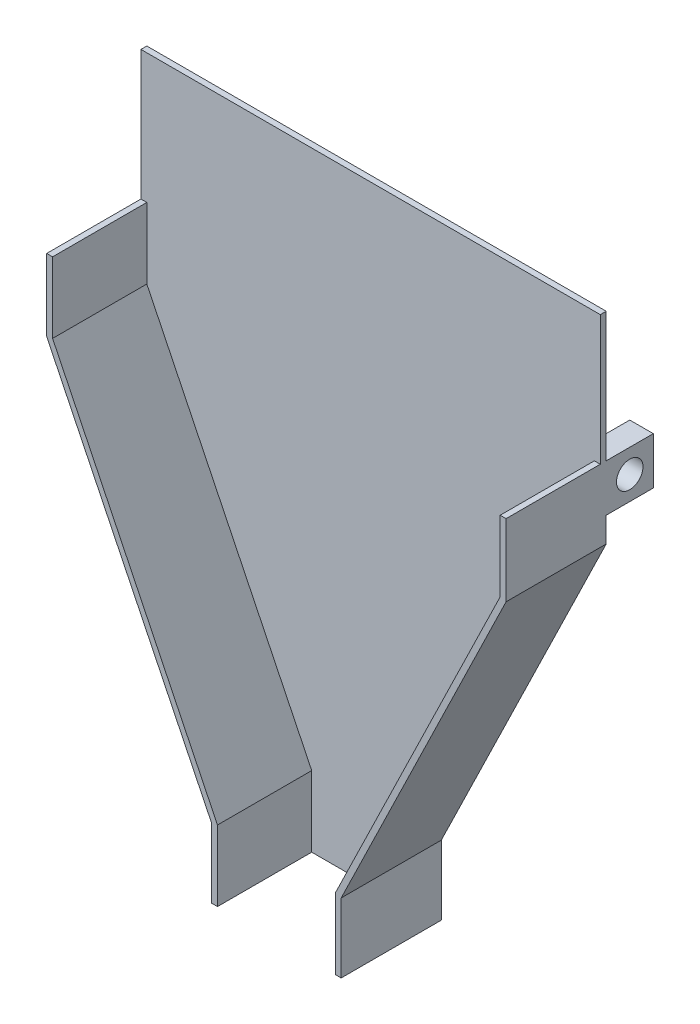
ISO-10303-21;
HEADER;
FILE_DESCRIPTION(('STEP AP214'),'2;1');
FILE_NAME('part.step','',(''),(''),'','','');
FILE_SCHEMA(('AUTOMOTIVE_DESIGN { 1 0 10303 214 1 1 1 1 }'));
ENDSEC;
DATA;
#1=APPLICATION_CONTEXT('core data for automotive mechanical design processes');
#2=APPLICATION_PROTOCOL_DEFINITION('international standard','automotive_design',2000,#1);
#3=PRODUCT_CONTEXT('',#1,'mechanical');
#4=PRODUCT('Part','Part','',(#3));
#5=PRODUCT_RELATED_PRODUCT_CATEGORY('part','',(#4));
#6=PRODUCT_DEFINITION_FORMATION('','',#4);
#7=PRODUCT_DEFINITION_CONTEXT('part definition',#1,'design');
#8=PRODUCT_DEFINITION('design','',#6,#7);
#9=PRODUCT_DEFINITION_SHAPE('','',#8);
#10=(LENGTH_UNIT() NAMED_UNIT(*) SI_UNIT(.MILLI.,.METRE.));
#11=(NAMED_UNIT(*) PLANE_ANGLE_UNIT() SI_UNIT($,.RADIAN.));
#12=(NAMED_UNIT(*) SI_UNIT($,.STERADIAN.) SOLID_ANGLE_UNIT());
#13=UNCERTAINTY_MEASURE_WITH_UNIT(LENGTH_MEASURE(1.E-05),#10,'distance_accuracy_value','');
#14=(GEOMETRIC_REPRESENTATION_CONTEXT(3) GLOBAL_UNCERTAINTY_ASSIGNED_CONTEXT((#13)) GLOBAL_UNIT_ASSIGNED_CONTEXT((#10,
#11,#12)) REPRESENTATION_CONTEXT('',''));
#15=CARTESIAN_POINT('',(0.,0.,0.));
#16=DIRECTION('',(0.,0.,1.));
#17=DIRECTION('',(1.,0.,0.));
#18=AXIS2_PLACEMENT_3D('',#15,#16,#17);
#19=CARTESIAN_POINT('',(-311.15,517.842362076429,-6.35));
#20=DIRECTION('',(0.,-1.,0.));
#21=DIRECTION('',(0.,0.,-1.));
#22=AXIS2_PLACEMENT_3D('',#19,#20,#21);
#23=PLANE('',#22);
#24=DIRECTION('',(-1.,0.,0.));
#25=VECTOR('',#24,1.);
#26=CARTESIAN_POINT('',(-311.15,517.842362076429,-6.35));
#27=LINE('',#26,#25);
#28=CARTESIAN_POINT('',(184.15,517.842362076429,-6.35));
#29=VERTEX_POINT('',#28);
#30=CARTESIAN_POINT('',(158.75,517.842362076429,-6.35));
#31=VERTEX_POINT('',#30);
#32=EDGE_CURVE('E59',#29,#31,#27,.T.);
#33=ORIENTED_EDGE('',*,*,#32,.F.);
#34=DIRECTION('',(0.,0.,1.));
#35=VECTOR('',#34,1.);
#36=CARTESIAN_POINT('',(184.15,517.842362076429,-57.15));
#37=LINE('',#36,#35);
#38=CARTESIAN_POINT('',(184.15,517.842362076429,-57.15));
#39=VERTEX_POINT('',#38);
#40=EDGE_CURVE('E390',#39,#29,#37,.T.);
#41=ORIENTED_EDGE('',*,*,#40,.F.);
#42=DIRECTION('',(1.,0.,0.));
#43=VECTOR('',#42,1.);
#44=CARTESIAN_POINT('',(184.15,517.842362076429,-57.15));
#45=LINE('',#44,#43);
#46=CARTESIAN_POINT('',(158.75,517.842362076429,-57.15));
#47=VERTEX_POINT('',#46);
#48=EDGE_CURVE('E379',#47,#39,#45,.T.);
#49=ORIENTED_EDGE('',*,*,#48,.F.);
#50=DIRECTION('',(0.,0.,1.));
#51=VECTOR('',#50,1.);
#52=CARTESIAN_POINT('',(158.75,517.842362076429,-57.15));
#53=LINE('',#52,#51);
#54=EDGE_CURVE('E394',#47,#31,#53,.T.);
#55=ORIENTED_EDGE('',*,*,#54,.T.);
#56=EDGE_LOOP('',(#33,#41,#49,#55));
#57=FACE_BOUND('',#56,.T.);
#58=ADVANCED_FACE('F47',(#57),#23,.F.);
#59=CARTESIAN_POINT('',(-285.75,517.842362076429,-6.35));
#60=VERTEX_POINT('',#59);
#61=CARTESIAN_POINT('',(-311.15,517.842362076429,-6.35));
#62=VERTEX_POINT('',#61);
#63=EDGE_CURVE('E11',#60,#62,#27,.T.);
#64=ORIENTED_EDGE('',*,*,#63,.F.);
#65=DIRECTION('',(0.,0.,1.));
#66=VECTOR('',#65,1.);
#67=CARTESIAN_POINT('',(-285.75,517.842362076429,-57.15));
#68=LINE('',#67,#66);
#69=CARTESIAN_POINT('',(-285.75,517.842362076429,-57.15));
#70=VERTEX_POINT('',#69);
#71=EDGE_CURVE('E270',#70,#60,#68,.T.);
#72=ORIENTED_EDGE('',*,*,#71,.F.);
#73=DIRECTION('',(1.,0.,0.));
#74=VECTOR('',#73,1.);
#75=CARTESIAN_POINT('',(-311.15,517.842362076429,-57.15));
#76=LINE('',#75,#74);
#77=CARTESIAN_POINT('',(-311.15,517.842362076429,-57.15));
#78=VERTEX_POINT('',#77);
#79=EDGE_CURVE('E296',#78,#70,#76,.T.);
#80=ORIENTED_EDGE('',*,*,#79,.F.);
#81=DIRECTION('',(0.,0.,1.));
#82=VECTOR('',#81,1.);
#83=CARTESIAN_POINT('',(-311.15,517.842362076429,-6.35));
#84=LINE('',#83,#82);
#85=EDGE_CURVE('E74',#78,#62,#84,.T.);
#86=ORIENTED_EDGE('',*,*,#85,.T.);
#87=EDGE_LOOP('',(#64,#72,#80,#86));
#88=FACE_BOUND('',#87,.T.);
#89=ADVANCED_FACE('F533',(#88),#23,.F.);
#90=DIRECTION('',(1.,0.,0.));
#91=VECTOR('',#90,1.);
#92=CARTESIAN_POINT('',(-311.15,517.842362076429,0.));
#93=LINE('',#92,#91);
#94=CARTESIAN_POINT('',(-311.15,517.842362076429,0.));
#95=VERTEX_POINT('',#94);
#96=CARTESIAN_POINT('',(-304.8,517.842362076429,0.));
#97=VERTEX_POINT('',#96);
#98=EDGE_CURVE('E66',#95,#97,#93,.T.);
#99=ORIENTED_EDGE('',*,*,#98,.F.);
#100=CARTESIAN_POINT('',(-311.15,517.842362076429,101.6));
#101=VERTEX_POINT('',#100);
#102=EDGE_CURVE('E250',#95,#101,#84,.T.);
#103=ORIENTED_EDGE('',*,*,#102,.T.);
#104=DIRECTION('',(1.,0.,0.));
#105=VECTOR('',#104,1.);
#106=CARTESIAN_POINT('',(-311.15,517.842362076429,101.6));
#107=LINE('',#106,#105);
#108=CARTESIAN_POINT('',(-304.8,517.842362076429,101.6));
#109=VERTEX_POINT('',#108);
#110=EDGE_CURVE('E493',#101,#109,#107,.T.);
#111=ORIENTED_EDGE('',*,*,#110,.T.);
#112=DIRECTION('',(0.,0.,1.));
#113=VECTOR('',#112,1.);
#114=CARTESIAN_POINT('',(-304.8,517.842362076429,-6.35));
#115=LINE('',#114,#113);
#116=EDGE_CURVE('E432',#97,#109,#115,.T.);
#117=ORIENTED_EDGE('',*,*,#116,.F.);
#118=EDGE_LOOP('',(#99,#103,#111,#117));
#119=FACE_BOUND('',#118,.T.);
#120=ADVANCED_FACE('F505',(#119),#23,.F.);
#121=CARTESIAN_POINT('',(177.8,517.842362076429,0.));
#122=VERTEX_POINT('',#121);
#123=CARTESIAN_POINT('',(184.15,517.842362076429,0.));
#124=VERTEX_POINT('',#123);
#125=EDGE_CURVE('E57',#122,#124,#93,.T.);
#126=ORIENTED_EDGE('',*,*,#125,.F.);
#127=DIRECTION('',(0.,0.,-1.));
#128=VECTOR('',#127,1.);
#129=CARTESIAN_POINT('',(177.8,517.842362076429,101.6));
#130=LINE('',#129,#128);
#131=CARTESIAN_POINT('',(177.8,517.842362076429,101.6));
#132=VERTEX_POINT('',#131);
#133=EDGE_CURVE('E340',#132,#122,#130,.T.);
#134=ORIENTED_EDGE('',*,*,#133,.F.);
#135=DIRECTION('',(1.,0.,0.));
#136=VECTOR('',#135,1.);
#137=CARTESIAN_POINT('',(177.8,517.842362076429,101.6));
#138=LINE('',#137,#136);
#139=CARTESIAN_POINT('',(184.15,517.842362076429,101.6));
#140=VERTEX_POINT('',#139);
#141=EDGE_CURVE('E322',#132,#140,#138,.T.);
#142=ORIENTED_EDGE('',*,*,#141,.T.);
#143=EDGE_CURVE('E382',#124,#140,#37,.T.);
#144=ORIENTED_EDGE('',*,*,#143,.F.);
#145=EDGE_LOOP('',(#126,#134,#142,#144));
#146=FACE_BOUND('',#145,.T.);
#147=ADVANCED_FACE('F536',(#146),#23,.F.);
#148=CARTESIAN_POINT('',(0.,0.,-6.35));
#149=DIRECTION('',(0.,0.,-1.));
#150=DIRECTION('',(-1.,0.,0.));
#151=AXIS2_PLACEMENT_3D('',#148,#149,#150);
#152=PLANE('',#151);
#153=DIRECTION('',(-1.,0.,0.));
#154=VECTOR('',#153,1.);
#155=CARTESIAN_POINT('',(-311.15,467.042362076429,-6.35));
#156=LINE('',#155,#154);
#157=CARTESIAN_POINT('',(-285.75,467.042362076429,-6.35));
#158=VERTEX_POINT('',#157);
#159=CARTESIAN_POINT('',(-311.15,467.042362076429,-6.35));
#160=VERTEX_POINT('',#159);
#161=EDGE_CURVE('E282',#158,#160,#156,.T.);
#162=ORIENTED_EDGE('',*,*,#161,.F.);
#163=DIRECTION('',(0.,-1.,0.));
#164=VECTOR('',#163,1.);
#165=CARTESIAN_POINT('',(-285.75,517.842362076429,-6.35));
#166=LINE('',#165,#164);
#167=EDGE_CURVE('E285',#60,#158,#166,.T.);
#168=ORIENTED_EDGE('',*,*,#167,.F.);
#169=ORIENTED_EDGE('',*,*,#63,.T.);
#170=DIRECTION('',(0.,-1.,0.));
#171=VECTOR('',#170,1.);
#172=CARTESIAN_POINT('',(-311.15,657.542362076429,-6.35));
#173=LINE('',#172,#171);
#174=CARTESIAN_POINT('',(-311.15,657.542362076429,-6.35));
#175=VERTEX_POINT('',#174);
#176=EDGE_CURVE('E582',#175,#62,#173,.T.);
#177=ORIENTED_EDGE('',*,*,#176,.F.);
#178=DIRECTION('',(-1.,0.,0.));
#179=VECTOR('',#178,1.);
#180=CARTESIAN_POINT('',(-311.15,657.542362076429,-6.35));
#181=LINE('',#180,#179);
#182=CARTESIAN_POINT('',(184.15,657.542362076429,-6.35));
#183=VERTEX_POINT('',#182);
#184=EDGE_CURVE('E242',#183,#175,#181,.T.);
#185=ORIENTED_EDGE('',*,*,#184,.F.);
#186=DIRECTION('',(0.,-1.,0.));
#187=VECTOR('',#186,1.);
#188=CARTESIAN_POINT('',(184.15,657.542362076429,-6.35));
#189=LINE('',#188,#187);
#190=EDGE_CURVE('E259',#183,#29,#189,.T.);
#191=ORIENTED_EDGE('',*,*,#190,.T.);
#192=ORIENTED_EDGE('',*,*,#32,.T.);
#193=DIRECTION('',(0.,1.,0.));
#194=VECTOR('',#193,1.);
#195=CARTESIAN_POINT('',(158.75,517.842362076429,-6.35));
#196=LINE('',#195,#194);
#197=CARTESIAN_POINT('',(158.75,467.042362076429,-6.35));
#198=VERTEX_POINT('',#197);
#199=EDGE_CURVE('E359',#198,#31,#196,.T.);
#200=ORIENTED_EDGE('',*,*,#199,.F.);
#201=DIRECTION('',(-1.,0.,0.));
#202=VECTOR('',#201,1.);
#203=CARTESIAN_POINT('',(184.15,467.042362076429,-6.35));
#204=LINE('',#203,#202);
#205=CARTESIAN_POINT('',(184.15,467.042362076429,-6.35));
#206=VERTEX_POINT('',#205);
#207=EDGE_CURVE('E383',#206,#198,#204,.T.);
#208=ORIENTED_EDGE('',*,*,#207,.F.);
#209=DIRECTION('',(0.,1.,0.));
#210=VECTOR('',#209,1.);
#211=CARTESIAN_POINT('',(184.15,517.842362076429,-6.35));
#212=LINE('',#211,#210);
#213=CARTESIAN_POINT('',(184.15,440.179589293445,-6.35));
#214=VERTEX_POINT('',#213);
#215=EDGE_CURVE('E306',#206,#214,#212,.F.);
#216=ORIENTED_EDGE('',*,*,#215,.T.);
#217=DIRECTION('',(-0.4375,-0.899218410621135,0.));
#218=VECTOR('',#217,1.);
#219=CARTESIAN_POINT('',(5.71003690744421,73.421875,-6.35));
#220=LINE('',#219,#218);
#221=CARTESIAN_POINT('',(6.35,74.7372272170153,-6.35));
#222=VERTEX_POINT('',#221);
#223=EDGE_CURVE('E363',#214,#222,#220,.T.);
#224=ORIENTED_EDGE('',*,*,#223,.T.);
#225=DIRECTION('',(0.,1.,0.));
#226=VECTOR('',#225,1.);
#227=CARTESIAN_POINT('',(6.35,0.,-6.35));
#228=LINE('',#227,#226);
#229=CARTESIAN_POINT('',(6.35,0.,-6.35));
#230=VERTEX_POINT('',#229);
#231=EDGE_CURVE('E290',#222,#230,#228,.F.);
#232=ORIENTED_EDGE('',*,*,#231,.T.);
#233=DIRECTION('',(-1.,0.,0.));
#234=VECTOR('',#233,1.);
#235=CARTESIAN_POINT('',(-127.,0.,-6.35));
#236=LINE('',#235,#234);
#237=CARTESIAN_POINT('',(-133.35,0.,-6.35));
#238=VERTEX_POINT('',#237);
#239=EDGE_CURVE('E435',#230,#238,#236,.T.);
#240=ORIENTED_EDGE('',*,*,#239,.T.);
#241=DIRECTION('',(0.,1.,0.));
#242=VECTOR('',#241,1.);
#243=CARTESIAN_POINT('',(-133.35,76.2,-6.35));
#244=LINE('',#243,#242);
#245=CARTESIAN_POINT('',(-133.35,74.7372272170153,-6.35));
#246=VERTEX_POINT('',#245);
#247=EDGE_CURVE('E458',#238,#246,#244,.T.);
#248=ORIENTED_EDGE('',*,*,#247,.T.);
#249=DIRECTION('',(-0.4375,0.899218410621135,0.));
#250=VECTOR('',#249,1.);
#251=CARTESIAN_POINT('',(-310.510036907444,438.864237076429,-6.35));
#252=LINE('',#251,#250);
#253=CARTESIAN_POINT('',(-311.15,440.179589293445,-6.35));
#254=VERTEX_POINT('',#253);
#255=EDGE_CURVE('E462',#246,#254,#252,.T.);
#256=ORIENTED_EDGE('',*,*,#255,.T.);
#257=DIRECTION('',(0.,1.,0.));
#258=VECTOR('',#257,1.);
#259=CARTESIAN_POINT('',(-311.15,441.642362076429,-6.35));
#260=LINE('',#259,#258);
#261=EDGE_CURVE('E466',#254,#160,#260,.T.);
#262=ORIENTED_EDGE('',*,*,#261,.T.);
#263=EDGE_LOOP('',(#162,#168,#169,#177,#185,#191,#192,#200,#208,#216,#224,#232,#240,#248,#256,#262));
#264=FACE_BOUND('',#263,.T.);
#265=ADVANCED_FACE('F543',(#264),#152,.T.);
#266=CARTESIAN_POINT('',(-304.8,441.642362076429,-6.35));
#267=DIRECTION('',(0.899218410621135,0.4375,0.));
#268=DIRECTION('',(-0.4375,0.899218410621135,0.));
#269=AXIS2_PLACEMENT_3D('',#266,#267,#268);
#270=PLANE('',#269);
#271=DIRECTION('',(0.4375,-0.899218410621135,0.));
#272=VECTOR('',#271,1.);
#273=CARTESIAN_POINT('',(-72.7137124859179,-35.3776666901368,0.));
#274=LINE('',#273,#272);
#275=CARTESIAN_POINT('',(-304.8,441.642362076429,0.));
#276=VERTEX_POINT('',#275);
#277=CARTESIAN_POINT('',(-127.,76.2,0.));
#278=VERTEX_POINT('',#277);
#279=EDGE_CURVE('E427',#276,#278,#274,.T.);
#280=ORIENTED_EDGE('',*,*,#279,.F.);
#281=DIRECTION('',(0.,0.,1.));
#282=VECTOR('',#281,1.);
#283=CARTESIAN_POINT('',(-304.8,441.642362076429,-6.35));
#284=LINE('',#283,#282);
#285=CARTESIAN_POINT('',(-304.8,441.642362076429,101.6));
#286=VERTEX_POINT('',#285);
#287=EDGE_CURVE('E431',#276,#286,#284,.T.);
#288=ORIENTED_EDGE('',*,*,#287,.T.);
#289=DIRECTION('',(-0.4375,0.899218410621135,0.));
#290=VECTOR('',#289,1.);
#291=CARTESIAN_POINT('',(-304.8,441.642362076429,101.6));
#292=LINE('',#291,#290);
#293=CARTESIAN_POINT('',(-127.,76.2,101.6));
#294=VERTEX_POINT('',#293);
#295=EDGE_CURVE('E470',#294,#286,#292,.T.);
#296=ORIENTED_EDGE('',*,*,#295,.F.);
#297=DIRECTION('',(0.,0.,1.));
#298=VECTOR('',#297,1.);
#299=CARTESIAN_POINT('',(-127.,76.2,-6.35));
#300=LINE('',#299,#298);
#301=EDGE_CURVE('E450',#278,#294,#300,.T.);
#302=ORIENTED_EDGE('',*,*,#301,.F.);
#303=EDGE_LOOP('',(#280,#288,#296,#302));
#304=FACE_BOUND('',#303,.T.);
#305=ADVANCED_FACE('F549',(#304),#270,.T.);
#306=CARTESIAN_POINT('',(0.,0.,101.6));
#307=DIRECTION('',(0.,0.,-1.));
#308=DIRECTION('',(-1.,0.,0.));
#309=AXIS2_PLACEMENT_3D('',#306,#307,#308);
#310=PLANE('',#309);
#311=DIRECTION('',(0.,1.,0.));
#312=VECTOR('',#311,1.);
#313=CARTESIAN_POINT('',(-304.8,441.642362076429,101.6));
#314=LINE('',#313,#312);
#315=EDGE_CURVE('E387',#286,#109,#314,.T.);
#316=ORIENTED_EDGE('',*,*,#315,.T.);
#317=ORIENTED_EDGE('',*,*,#110,.F.);
#318=DIRECTION('',(0.,1.,0.));
#319=VECTOR('',#318,1.);
#320=CARTESIAN_POINT('',(-311.15,441.642362076429,101.6));
#321=LINE('',#320,#319);
#322=CARTESIAN_POINT('',(-311.15,440.179589293445,101.6));
#323=VERTEX_POINT('',#322);
#324=EDGE_CURVE('E490',#323,#101,#321,.T.);
#325=ORIENTED_EDGE('',*,*,#324,.F.);
#326=DIRECTION('',(-0.4375,0.899218410621135,0.));
#327=VECTOR('',#326,1.);
#328=CARTESIAN_POINT('',(-310.510036907444,438.864237076429,101.6));
#329=LINE('',#328,#327);
#330=CARTESIAN_POINT('',(-133.35,74.7372272170153,101.6));
#331=VERTEX_POINT('',#330);
#332=EDGE_CURVE('E486',#331,#323,#329,.T.);
#333=ORIENTED_EDGE('',*,*,#332,.F.);
#334=DIRECTION('',(0.,1.,0.));
#335=VECTOR('',#334,1.);
#336=CARTESIAN_POINT('',(-133.35,76.2,101.6));
#337=LINE('',#336,#335);
#338=CARTESIAN_POINT('',(-133.35,0.,101.6));
#339=VERTEX_POINT('',#338);
#340=EDGE_CURVE('E482',#339,#331,#337,.T.);
#341=ORIENTED_EDGE('',*,*,#340,.F.);
#342=DIRECTION('',(-1.,0.,0.));
#343=VECTOR('',#342,1.);
#344=CARTESIAN_POINT('',(-127.,0.,101.6));
#345=LINE('',#344,#343);
#346=CARTESIAN_POINT('',(-127.,0.,101.6));
#347=VERTEX_POINT('',#346);
#348=EDGE_CURVE('E478',#347,#339,#345,.T.);
#349=ORIENTED_EDGE('',*,*,#348,.F.);
#350=DIRECTION('',(0.,1.,0.));
#351=VECTOR('',#350,1.);
#352=CARTESIAN_POINT('',(-127.,76.2,101.6));
#353=LINE('',#352,#351);
#354=EDGE_CURVE('E474',#347,#294,#353,.T.);
#355=ORIENTED_EDGE('',*,*,#354,.T.);
#356=ORIENTED_EDGE('',*,*,#295,.T.);
#357=EDGE_LOOP('',(#316,#317,#325,#333,#341,#349,#355,#356));
#358=FACE_BOUND('',#357,.T.);
#359=ADVANCED_FACE('F49',(#358),#310,.F.);
#360=CARTESIAN_POINT('',(-127.,76.2,-6.35));
#361=DIRECTION('',(1.,0.,0.));
#362=DIRECTION('',(0.,1.,0.));
#363=AXIS2_PLACEMENT_3D('',#360,#361,#362);
#364=PLANE('',#363);
#365=DIRECTION('',(0.,-1.,0.));
#366=VECTOR('',#365,1.);
#367=CARTESIAN_POINT('',(-127.,0.,0.));
#368=LINE('',#367,#366);
#369=CARTESIAN_POINT('',(-127.,0.,0.));
#370=VERTEX_POINT('',#369);
#371=EDGE_CURVE('E406',#278,#370,#368,.T.);
#372=ORIENTED_EDGE('',*,*,#371,.F.);
#373=ORIENTED_EDGE('',*,*,#301,.T.);
#374=ORIENTED_EDGE('',*,*,#354,.F.);
#375=DIRECTION('',(0.,0.,1.));
#376=VECTOR('',#375,1.);
#377=CARTESIAN_POINT('',(-127.,0.,-6.35));
#378=LINE('',#377,#376);
#379=EDGE_CURVE('E447',#370,#347,#378,.T.);
#380=ORIENTED_EDGE('',*,*,#379,.F.);
#381=EDGE_LOOP('',(#372,#373,#374,#380));
#382=FACE_BOUND('',#381,.T.);
#383=ADVANCED_FACE('F618',(#382),#364,.T.);
#384=CARTESIAN_POINT('',(-127.,0.,-6.35));
#385=DIRECTION('',(0.,1.,0.));
#386=DIRECTION('',(0.,0.,1.));
#387=AXIS2_PLACEMENT_3D('',#384,#385,#386);
#388=PLANE('',#387);
#389=DIRECTION('',(0.,0.,1.));
#390=VECTOR('',#389,1.);
#391=CARTESIAN_POINT('',(-133.35,0.,-6.35));
#392=LINE('',#391,#390);
#393=EDGE_CURVE('E444',#238,#339,#392,.T.);
#394=ORIENTED_EDGE('',*,*,#393,.F.);
#395=ORIENTED_EDGE('',*,*,#239,.F.);
#396=DIRECTION('',(0.,0.,-1.));
#397=VECTOR('',#396,1.);
#398=CARTESIAN_POINT('',(6.35,0.,101.6));
#399=LINE('',#398,#397);
#400=CARTESIAN_POINT('',(6.35,0.,101.6));
#401=VERTEX_POINT('',#400);
#402=EDGE_CURVE('E351',#401,#230,#399,.T.);
#403=ORIENTED_EDGE('',*,*,#402,.F.);
#404=DIRECTION('',(-1.,0.,0.));
#405=VECTOR('',#404,1.);
#406=CARTESIAN_POINT('',(6.35,0.,101.6));
#407=LINE('',#406,#405);
#408=CARTESIAN_POINT('',(0.,0.,101.6));
#409=VERTEX_POINT('',#408);
#410=EDGE_CURVE('E305',#401,#409,#407,.T.);
#411=ORIENTED_EDGE('',*,*,#410,.T.);
#412=DIRECTION('',(0.,0.,-1.));
#413=VECTOR('',#412,1.);
#414=CARTESIAN_POINT('',(0.,0.,101.6));
#415=LINE('',#414,#413);
#416=CARTESIAN_POINT('',(0.,0.,0.));
#417=VERTEX_POINT('',#416);
#418=EDGE_CURVE('E355',#409,#417,#415,.T.);
#419=ORIENTED_EDGE('',*,*,#418,.T.);
#420=DIRECTION('',(1.,0.,0.));
#421=VECTOR('',#420,1.);
#422=CARTESIAN_POINT('',(0.,0.,0.));
#423=LINE('',#422,#421);
#424=EDGE_CURVE('E409',#370,#417,#423,.T.);
#425=ORIENTED_EDGE('',*,*,#424,.F.);
#426=ORIENTED_EDGE('',*,*,#379,.T.);
#427=ORIENTED_EDGE('',*,*,#348,.T.);
#428=EDGE_LOOP('',(#394,#395,#403,#411,#419,#425,#426,#427));
#429=FACE_BOUND('',#428,.T.);
#430=ADVANCED_FACE('F610',(#429),#388,.F.);
#431=CARTESIAN_POINT('',(-133.35,76.2,-6.35));
#432=DIRECTION('',(1.,0.,0.));
#433=DIRECTION('',(0.,1.,0.));
#434=AXIS2_PLACEMENT_3D('',#431,#432,#433);
#435=PLANE('',#434);
#436=DIRECTION('',(0.,0.,1.));
#437=VECTOR('',#436,1.);
#438=CARTESIAN_POINT('',(-133.35,74.7372272170153,-6.35));
#439=LINE('',#438,#437);
#440=EDGE_CURVE('E441',#246,#331,#439,.T.);
#441=ORIENTED_EDGE('',*,*,#440,.F.);
#442=ORIENTED_EDGE('',*,*,#247,.F.);
#443=ORIENTED_EDGE('',*,*,#393,.T.);
#444=ORIENTED_EDGE('',*,*,#340,.T.);
#445=EDGE_LOOP('',(#441,#442,#443,#444));
#446=FACE_BOUND('',#445,.T.);
#447=ADVANCED_FACE('F608',(#446),#435,.F.);
#448=CARTESIAN_POINT('',(-310.510036907444,438.864237076429,-6.35));
#449=DIRECTION('',(0.899218410621135,0.4375,0.));
#450=DIRECTION('',(-0.4375,0.899218410621135,0.));
#451=AXIS2_PLACEMENT_3D('',#448,#449,#450);
#452=PLANE('',#451);
#453=DIRECTION('',(0.,0.,1.));
#454=VECTOR('',#453,1.);
#455=CARTESIAN_POINT('',(-311.15,440.179589293445,-6.35));
#456=LINE('',#455,#454);
#457=EDGE_CURVE('E438',#254,#323,#456,.T.);
#458=ORIENTED_EDGE('',*,*,#457,.F.);
#459=ORIENTED_EDGE('',*,*,#255,.F.);
#460=ORIENTED_EDGE('',*,*,#440,.T.);
#461=ORIENTED_EDGE('',*,*,#332,.T.);
#462=EDGE_LOOP('',(#458,#459,#460,#461));
#463=FACE_BOUND('',#462,.T.);
#464=ADVANCED_FACE('F603',(#463),#452,.F.);
#465=CARTESIAN_POINT('',(-311.15,441.642362076429,-6.35));
#466=DIRECTION('',(1.,0.,0.));
#467=DIRECTION('',(0.,0.,-1.));
#468=AXIS2_PLACEMENT_3D('',#465,#466,#467);
#469=PLANE('',#468);
#470=CARTESIAN_POINT('',(-311.15,492.442362076429,-31.75));
#471=DIRECTION('',(1.,0.,0.));
#472=DIRECTION('',(0.,0.,-1.));
#473=AXIS2_PLACEMENT_3D('',#470,#471,#472);
#474=CIRCLE('',#473,14.2875);
#475=CARTESIAN_POINT('',(-311.15,492.442362076429,-46.0375));
#476=VERTEX_POINT('',#475);
#477=EDGE_CURVE('E257',#476,#476,#474,.T.);
#478=ORIENTED_EDGE('',*,*,#477,.T.);
#479=EDGE_LOOP('',(#478));
#480=FACE_BOUND('',#479,.T.);
#481=ORIENTED_EDGE('',*,*,#85,.F.);
#482=DIRECTION('',(0.,1.,0.));
#483=VECTOR('',#482,1.);
#484=CARTESIAN_POINT('',(-311.15,517.842362076429,-57.15));
#485=LINE('',#484,#483);
#486=CARTESIAN_POINT('',(-311.15,467.042362076429,-57.15));
#487=VERTEX_POINT('',#486);
#488=EDGE_CURVE('E286',#487,#78,#485,.T.);
#489=ORIENTED_EDGE('',*,*,#488,.F.);
#490=DIRECTION('',(0.,0.,1.));
#491=VECTOR('',#490,1.);
#492=CARTESIAN_POINT('',(-311.15,467.042362076429,-57.15));
#493=LINE('',#492,#491);
#494=EDGE_CURVE('E277',#487,#160,#493,.T.);
#495=ORIENTED_EDGE('',*,*,#494,.T.);
#496=ORIENTED_EDGE('',*,*,#261,.F.);
#497=ORIENTED_EDGE('',*,*,#457,.T.);
#498=ORIENTED_EDGE('',*,*,#324,.T.);
#499=ORIENTED_EDGE('',*,*,#102,.F.);
#500=DIRECTION('',(0.,-1.,0.));
#501=VECTOR('',#500,1.);
#502=CARTESIAN_POINT('',(-311.15,657.542362076429,0.));
#503=LINE('',#502,#501);
#504=CARTESIAN_POINT('',(-311.15,657.542362076429,0.));
#505=VERTEX_POINT('',#504);
#506=EDGE_CURVE('E229',#505,#95,#503,.T.);
#507=ORIENTED_EDGE('',*,*,#506,.F.);
#508=DIRECTION('',(0.,0.,1.));
#509=VECTOR('',#508,1.);
#510=CARTESIAN_POINT('',(-311.15,657.542362076429,0.));
#511=LINE('',#510,#509);
#512=EDGE_CURVE('E237',#175,#505,#511,.T.);
#513=ORIENTED_EDGE('',*,*,#512,.F.);
#514=ORIENTED_EDGE('',*,*,#176,.T.);
#515=EDGE_LOOP('',(#481,#489,#495,#496,#497,#498,#499,#507,#513,#514));
#516=FACE_BOUND('',#515,.T.);
#517=ADVANCED_FACE('F248',(#480,#516),#469,.F.);
#518=CARTESIAN_POINT('',(-304.8,441.642362076429,-6.35));
#519=DIRECTION('',(1.,0.,0.));
#520=DIRECTION('',(0.,0.,-1.));
#521=AXIS2_PLACEMENT_3D('',#518,#519,#520);
#522=PLANE('',#521);
#523=DIRECTION('',(0.,1.,0.));
#524=VECTOR('',#523,1.);
#525=CARTESIAN_POINT('',(-304.8,0.,0.));
#526=LINE('',#525,#524);
#527=EDGE_CURVE('E424',#276,#97,#526,.T.);
#528=ORIENTED_EDGE('',*,*,#527,.T.);
#529=ORIENTED_EDGE('',*,*,#116,.T.);
#530=ORIENTED_EDGE('',*,*,#315,.F.);
#531=ORIENTED_EDGE('',*,*,#287,.F.);
#532=EDGE_LOOP('',(#528,#529,#530,#531));
#533=FACE_BOUND('',#532,.T.);
#534=ADVANCED_FACE('F621',(#533),#522,.T.);
#535=CARTESIAN_POINT('',(0.,0.,0.));
#536=DIRECTION('',(0.,0.,1.));
#537=DIRECTION('',(1.,0.,0.));
#538=AXIS2_PLACEMENT_3D('',#535,#536,#537);
#539=PLANE('',#538);
#540=ORIENTED_EDGE('',*,*,#371,.T.);
#541=ORIENTED_EDGE('',*,*,#424,.T.);
#542=DIRECTION('',(0.,1.,0.));
#543=VECTOR('',#542,1.);
#544=CARTESIAN_POINT('',(0.,0.,0.));
#545=LINE('',#544,#543);
#546=CARTESIAN_POINT('',(0.,76.2,0.));
#547=VERTEX_POINT('',#546);
#548=EDGE_CURVE('E413',#417,#547,#545,.T.);
#549=ORIENTED_EDGE('',*,*,#548,.T.);
#550=DIRECTION('',(0.4375,0.899218410621135,0.));
#551=VECTOR('',#550,1.);
#552=CARTESIAN_POINT('',(-29.9776937640821,14.58515625,0.));
#553=LINE('',#552,#551);
#554=CARTESIAN_POINT('',(177.8,441.642362076429,0.));
#555=VERTEX_POINT('',#554);
#556=EDGE_CURVE('E417',#547,#555,#553,.T.);
#557=ORIENTED_EDGE('',*,*,#556,.T.);
#558=DIRECTION('',(0.,-1.,0.));
#559=VECTOR('',#558,1.);
#560=CARTESIAN_POINT('',(177.8,0.,0.));
#561=LINE('',#560,#559);
#562=EDGE_CURVE('E421',#122,#555,#561,.T.);
#563=ORIENTED_EDGE('',*,*,#562,.F.);
#564=ORIENTED_EDGE('',*,*,#125,.T.);
#565=DIRECTION('',(0.,-1.,0.));
#566=VECTOR('',#565,1.);
#567=CARTESIAN_POINT('',(184.15,657.542362076429,0.));
#568=LINE('',#567,#566);
#569=CARTESIAN_POINT('',(184.15,657.542362076429,0.));
#570=VERTEX_POINT('',#569);
#571=EDGE_CURVE('E232',#570,#124,#568,.T.);
#572=ORIENTED_EDGE('',*,*,#571,.F.);
#573=DIRECTION('',(1.,0.,0.));
#574=VECTOR('',#573,1.);
#575=CARTESIAN_POINT('',(-311.15,657.542362076429,0.));
#576=LINE('',#575,#574);
#577=EDGE_CURVE('E224',#505,#570,#576,.T.);
#578=ORIENTED_EDGE('',*,*,#577,.F.);
#579=ORIENTED_EDGE('',*,*,#506,.T.);
#580=ORIENTED_EDGE('',*,*,#98,.T.);
#581=ORIENTED_EDGE('',*,*,#527,.F.);
#582=ORIENTED_EDGE('',*,*,#279,.T.);
#583=EDGE_LOOP('',(#540,#541,#549,#557,#563,#564,#572,#578,#579,#580,#581,#582));
#584=FACE_BOUND('',#583,.T.);
#585=ADVANCED_FACE('F227',(#584),#539,.T.);
#586=CARTESIAN_POINT('',(184.15,517.842362076429,-57.15));
#587=DIRECTION('',(-1.,0.,0.));
#588=DIRECTION('',(0.,0.,1.));
#589=AXIS2_PLACEMENT_3D('',#586,#587,#588);
#590=PLANE('',#589);
#591=CARTESIAN_POINT('',(184.15,492.442362076429,-31.75));
#592=DIRECTION('',(1.,0.,0.));
#593=DIRECTION('',(0.,0.,-1.));
#594=AXIS2_PLACEMENT_3D('',#591,#592,#593);
#595=CIRCLE('',#594,14.2875);
#596=CARTESIAN_POINT('',(184.15,492.442362076429,-46.0375));
#597=VERTEX_POINT('',#596);
#598=EDGE_CURVE('E252',#597,#597,#595,.T.);
#599=ORIENTED_EDGE('',*,*,#598,.F.);
#600=EDGE_LOOP('',(#599));
#601=FACE_BOUND('',#600,.T.);
#602=ORIENTED_EDGE('',*,*,#40,.T.);
#603=ORIENTED_EDGE('',*,*,#190,.F.);
#604=DIRECTION('',(0.,0.,-1.));
#605=VECTOR('',#604,1.);
#606=CARTESIAN_POINT('',(184.15,657.542362076429,0.));
#607=LINE('',#606,#605);
#608=EDGE_CURVE('E236',#570,#183,#607,.T.);
#609=ORIENTED_EDGE('',*,*,#608,.F.);
#610=ORIENTED_EDGE('',*,*,#571,.T.);
#611=ORIENTED_EDGE('',*,*,#143,.T.);
#612=DIRECTION('',(0.,1.,0.));
#613=VECTOR('',#612,1.);
#614=CARTESIAN_POINT('',(184.15,517.842362076429,101.6));
#615=LINE('',#614,#613);
#616=CARTESIAN_POINT('',(184.15,440.179589293445,101.6));
#617=VERTEX_POINT('',#616);
#618=EDGE_CURVE('E318',#140,#617,#615,.F.);
#619=ORIENTED_EDGE('',*,*,#618,.T.);
#620=DIRECTION('',(0.,0.,-1.));
#621=VECTOR('',#620,1.);
#622=CARTESIAN_POINT('',(184.15,440.179589293445,101.6));
#623=LINE('',#622,#621);
#624=EDGE_CURVE('E344',#617,#214,#623,.T.);
#625=ORIENTED_EDGE('',*,*,#624,.T.);
#626=ORIENTED_EDGE('',*,*,#215,.F.);
#627=DIRECTION('',(0.,0.,1.));
#628=VECTOR('',#627,1.);
#629=CARTESIAN_POINT('',(184.15,467.042362076429,-57.15));
#630=LINE('',#629,#628);
#631=CARTESIAN_POINT('',(184.15,467.042362076429,-57.15));
#632=VERTEX_POINT('',#631);
#633=EDGE_CURVE('E402',#632,#206,#630,.T.);
#634=ORIENTED_EDGE('',*,*,#633,.F.);
#635=DIRECTION('',(0.,-1.,0.));
#636=VECTOR('',#635,1.);
#637=CARTESIAN_POINT('',(184.15,517.842362076429,-57.15));
#638=LINE('',#637,#636);
#639=EDGE_CURVE('E369',#39,#632,#638,.T.);
#640=ORIENTED_EDGE('',*,*,#639,.F.);
#641=EDGE_LOOP('',(#602,#603,#609,#610,#611,#619,#625,#626,#634,#640));
#642=FACE_BOUND('',#641,.T.);
#643=ADVANCED_FACE('F574',(#601,#642),#590,.F.);
#644=CARTESIAN_POINT('',(184.15,467.042362076429,-57.15));
#645=DIRECTION('',(0.,1.,0.));
#646=DIRECTION('',(0.,0.,1.));
#647=AXIS2_PLACEMENT_3D('',#644,#645,#646);
#648=PLANE('',#647);
#649=ORIENTED_EDGE('',*,*,#633,.T.);
#650=ORIENTED_EDGE('',*,*,#207,.T.);
#651=DIRECTION('',(0.,0.,1.));
#652=VECTOR('',#651,1.);
#653=CARTESIAN_POINT('',(158.75,467.042362076429,-57.15));
#654=LINE('',#653,#652);
#655=CARTESIAN_POINT('',(158.75,467.042362076429,-57.15));
#656=VERTEX_POINT('',#655);
#657=EDGE_CURVE('E398',#656,#198,#654,.T.);
#658=ORIENTED_EDGE('',*,*,#657,.F.);
#659=DIRECTION('',(-1.,0.,0.));
#660=VECTOR('',#659,1.);
#661=CARTESIAN_POINT('',(184.15,467.042362076429,-57.15));
#662=LINE('',#661,#660);
#663=EDGE_CURVE('E373',#632,#656,#662,.T.);
#664=ORIENTED_EDGE('',*,*,#663,.F.);
#665=EDGE_LOOP('',(#649,#650,#658,#664));
#666=FACE_BOUND('',#665,.T.);
#667=ADVANCED_FACE('F632',(#666),#648,.F.);
#668=CARTESIAN_POINT('',(158.75,517.842362076429,-57.15));
#669=DIRECTION('',(1.,0.,0.));
#670=DIRECTION('',(0.,0.,-1.));
#671=AXIS2_PLACEMENT_3D('',#668,#669,#670);
#672=PLANE('',#671);
#673=CARTESIAN_POINT('',(158.75,492.442362076429,-31.75));
#674=DIRECTION('',(1.,0.,0.));
#675=DIRECTION('',(0.,0.,-1.));
#676=AXIS2_PLACEMENT_3D('',#673,#674,#675);
#677=CIRCLE('',#676,14.2875);
#678=CARTESIAN_POINT('',(158.75,492.442362076429,-46.0375));
#679=VERTEX_POINT('',#678);
#680=EDGE_CURVE('E266',#679,#679,#677,.T.);
#681=ORIENTED_EDGE('',*,*,#680,.T.);
#682=EDGE_LOOP('',(#681));
#683=FACE_BOUND('',#682,.T.);
#684=ORIENTED_EDGE('',*,*,#199,.T.);
#685=ORIENTED_EDGE('',*,*,#54,.F.);
#686=DIRECTION('',(0.,1.,0.));
#687=VECTOR('',#686,1.);
#688=CARTESIAN_POINT('',(158.75,517.842362076429,-57.15));
#689=LINE('',#688,#687);
#690=EDGE_CURVE('E376',#656,#47,#689,.T.);
#691=ORIENTED_EDGE('',*,*,#690,.F.);
#692=ORIENTED_EDGE('',*,*,#657,.T.);
#693=EDGE_LOOP('',(#684,#685,#691,#692));
#694=FACE_BOUND('',#693,.T.);
#695=ADVANCED_FACE('F636',(#683,#694),#672,.F.);
#696=CARTESIAN_POINT('',(0.,0.,-57.15));
#697=DIRECTION('',(0.,0.,-1.));
#698=DIRECTION('',(-1.,0.,0.));
#699=AXIS2_PLACEMENT_3D('',#696,#697,#698);
#700=PLANE('',#699);
#701=ORIENTED_EDGE('',*,*,#639,.T.);
#702=ORIENTED_EDGE('',*,*,#663,.T.);
#703=ORIENTED_EDGE('',*,*,#690,.T.);
#704=ORIENTED_EDGE('',*,*,#48,.T.);
#705=EDGE_LOOP('',(#701,#702,#703,#704));
#706=FACE_BOUND('',#705,.T.);
#707=ADVANCED_FACE('F640',(#706),#700,.T.);
#708=CARTESIAN_POINT('',(0.,0.,101.6));
#709=DIRECTION('',(1.,0.,0.));
#710=DIRECTION('',(0.,0.,-1.));
#711=AXIS2_PLACEMENT_3D('',#708,#709,#710);
#712=PLANE('',#711);
#713=ORIENTED_EDGE('',*,*,#548,.F.);
#714=ORIENTED_EDGE('',*,*,#418,.F.);
#715=DIRECTION('',(0.,-1.,0.));
#716=VECTOR('',#715,1.);
#717=CARTESIAN_POINT('',(0.,0.,101.6));
#718=LINE('',#717,#716);
#719=CARTESIAN_POINT('',(0.,76.2,101.6));
#720=VERTEX_POINT('',#719);
#721=EDGE_CURVE('E302',#720,#409,#718,.T.);
#722=ORIENTED_EDGE('',*,*,#721,.F.);
#723=DIRECTION('',(0.,0.,-1.));
#724=VECTOR('',#723,1.);
#725=CARTESIAN_POINT('',(0.,76.2,101.6));
#726=LINE('',#725,#724);
#727=EDGE_CURVE('E332',#720,#547,#726,.T.);
#728=ORIENTED_EDGE('',*,*,#727,.T.);
#729=EDGE_LOOP('',(#713,#714,#722,#728));
#730=FACE_BOUND('',#729,.T.);
#731=ADVANCED_FACE('F565',(#730),#712,.F.);
#732=CARTESIAN_POINT('',(6.35,0.,101.6));
#733=DIRECTION('',(1.,0.,0.));
#734=DIRECTION('',(0.,0.,-1.));
#735=AXIS2_PLACEMENT_3D('',#732,#733,#734);
#736=PLANE('',#735);
#737=ORIENTED_EDGE('',*,*,#402,.T.);
#738=ORIENTED_EDGE('',*,*,#231,.F.);
#739=DIRECTION('',(0.,0.,-1.));
#740=VECTOR('',#739,1.);
#741=CARTESIAN_POINT('',(6.35,74.7372272170153,101.6));
#742=LINE('',#741,#740);
#743=CARTESIAN_POINT('',(6.35,74.7372272170153,101.6));
#744=VERTEX_POINT('',#743);
#745=EDGE_CURVE('E348',#744,#222,#742,.T.);
#746=ORIENTED_EDGE('',*,*,#745,.F.);
#747=DIRECTION('',(0.,1.,0.));
#748=VECTOR('',#747,1.);
#749=CARTESIAN_POINT('',(6.35,0.,101.6));
#750=LINE('',#749,#748);
#751=EDGE_CURVE('E310',#744,#401,#750,.F.);
#752=ORIENTED_EDGE('',*,*,#751,.T.);
#753=EDGE_LOOP('',(#737,#738,#746,#752));
#754=FACE_BOUND('',#753,.T.);
#755=ADVANCED_FACE('F613',(#754),#736,.T.);
#756=CARTESIAN_POINT('',(5.71003690744421,73.421875,101.6));
#757=DIRECTION('',(0.899218410621135,-0.4375,0.));
#758=DIRECTION('',(0.4375,0.899218410621135,0.));
#759=AXIS2_PLACEMENT_3D('',#756,#757,#758);
#760=PLANE('',#759);
#761=ORIENTED_EDGE('',*,*,#745,.T.);
#762=ORIENTED_EDGE('',*,*,#223,.F.);
#763=ORIENTED_EDGE('',*,*,#624,.F.);
#764=DIRECTION('',(-0.4375,-0.899218410621135,0.));
#765=VECTOR('',#764,1.);
#766=CARTESIAN_POINT('',(5.71003690744421,73.421875,101.6));
#767=LINE('',#766,#765);
#768=EDGE_CURVE('E314',#617,#744,#767,.T.);
#769=ORIENTED_EDGE('',*,*,#768,.T.);
#770=EDGE_LOOP('',(#761,#762,#763,#769));
#771=FACE_BOUND('',#770,.T.);
#772=ADVANCED_FACE('F649',(#771),#760,.T.);
#773=CARTESIAN_POINT('',(177.8,517.842362076429,101.6));
#774=DIRECTION('',(1.,0.,0.));
#775=DIRECTION('',(0.,0.,-1.));
#776=AXIS2_PLACEMENT_3D('',#773,#774,#775);
#777=PLANE('',#776);
#778=ORIENTED_EDGE('',*,*,#562,.T.);
#779=DIRECTION('',(0.,0.,-1.));
#780=VECTOR('',#779,1.);
#781=CARTESIAN_POINT('',(177.8,441.642362076429,101.6));
#782=LINE('',#781,#780);
#783=CARTESIAN_POINT('',(177.8,441.642362076429,101.6));
#784=VERTEX_POINT('',#783);
#785=EDGE_CURVE('E336',#784,#555,#782,.T.);
#786=ORIENTED_EDGE('',*,*,#785,.F.);
#787=DIRECTION('',(0.,-1.,0.));
#788=VECTOR('',#787,1.);
#789=CARTESIAN_POINT('',(177.8,517.842362076429,101.6));
#790=LINE('',#789,#788);
#791=EDGE_CURVE('E326',#132,#784,#790,.T.);
#792=ORIENTED_EDGE('',*,*,#791,.F.);
#793=ORIENTED_EDGE('',*,*,#133,.T.);
#794=EDGE_LOOP('',(#778,#786,#792,#793));
#795=FACE_BOUND('',#794,.T.);
#796=ADVANCED_FACE('F556',(#795),#777,.F.);
#797=CARTESIAN_POINT('',(0.,76.2,101.6));
#798=DIRECTION('',(0.899218410621135,-0.4375,0.));
#799=DIRECTION('',(0.4375,0.899218410621135,0.));
#800=AXIS2_PLACEMENT_3D('',#797,#798,#799);
#801=PLANE('',#800);
#802=ORIENTED_EDGE('',*,*,#556,.F.);
#803=ORIENTED_EDGE('',*,*,#727,.F.);
#804=DIRECTION('',(-0.4375,-0.899218410621135,0.));
#805=VECTOR('',#804,1.);
#806=CARTESIAN_POINT('',(0.,76.2,101.6));
#807=LINE('',#806,#805);
#808=EDGE_CURVE('E329',#784,#720,#807,.T.);
#809=ORIENTED_EDGE('',*,*,#808,.F.);
#810=ORIENTED_EDGE('',*,*,#785,.T.);
#811=EDGE_LOOP('',(#802,#803,#809,#810));
#812=FACE_BOUND('',#811,.T.);
#813=ADVANCED_FACE('F561',(#812),#801,.F.);
#814=CARTESIAN_POINT('',(0.,0.,101.6));
#815=DIRECTION('',(0.,0.,-1.));
#816=DIRECTION('',(-1.,0.,0.));
#817=AXIS2_PLACEMENT_3D('',#814,#815,#816);
#818=PLANE('',#817);
#819=ORIENTED_EDGE('',*,*,#721,.T.);
#820=ORIENTED_EDGE('',*,*,#410,.F.);
#821=ORIENTED_EDGE('',*,*,#751,.F.);
#822=ORIENTED_EDGE('',*,*,#768,.F.);
#823=ORIENTED_EDGE('',*,*,#618,.F.);
#824=ORIENTED_EDGE('',*,*,#141,.F.);
#825=ORIENTED_EDGE('',*,*,#791,.T.);
#826=ORIENTED_EDGE('',*,*,#808,.T.);
#827=EDGE_LOOP('',(#819,#820,#821,#822,#823,#824,#825,#826));
#828=FACE_BOUND('',#827,.T.);
#829=ADVANCED_FACE('F569',(#828),#818,.F.);
#830=CARTESIAN_POINT('',(-285.75,517.842362076429,-57.15));
#831=DIRECTION('',(-1.,0.,0.));
#832=DIRECTION('',(0.,0.,1.));
#833=AXIS2_PLACEMENT_3D('',#830,#831,#832);
#834=PLANE('',#833);
#835=CARTESIAN_POINT('',(-285.75,492.442362076429,-31.75));
#836=DIRECTION('',(-1.,0.,0.));
#837=DIRECTION('',(0.,0.,1.));
#838=AXIS2_PLACEMENT_3D('',#835,#836,#837);
#839=CIRCLE('',#838,14.2875);
#840=CARTESIAN_POINT('',(-285.75,492.442362076429,-17.4625));
#841=VERTEX_POINT('',#840);
#842=EDGE_CURVE('E51',#841,#841,#839,.T.);
#843=ORIENTED_EDGE('',*,*,#842,.T.);
#844=EDGE_LOOP('',(#843));
#845=FACE_BOUND('',#844,.T.);
#846=ORIENTED_EDGE('',*,*,#167,.T.);
#847=DIRECTION('',(0.,0.,1.));
#848=VECTOR('',#847,1.);
#849=CARTESIAN_POINT('',(-285.75,467.042362076429,-57.15));
#850=LINE('',#849,#848);
#851=CARTESIAN_POINT('',(-285.75,467.042362076429,-57.15));
#852=VERTEX_POINT('',#851);
#853=EDGE_CURVE('E274',#852,#158,#850,.T.);
#854=ORIENTED_EDGE('',*,*,#853,.F.);
#855=DIRECTION('',(0.,-1.,0.));
#856=VECTOR('',#855,1.);
#857=CARTESIAN_POINT('',(-285.75,517.842362076429,-57.15));
#858=LINE('',#857,#856);
#859=EDGE_CURVE('E293',#70,#852,#858,.T.);
#860=ORIENTED_EDGE('',*,*,#859,.F.);
#861=ORIENTED_EDGE('',*,*,#71,.T.);
#862=EDGE_LOOP('',(#846,#854,#860,#861));
#863=FACE_BOUND('',#862,.T.);
#864=ADVANCED_FACE('F512',(#845,#863),#834,.F.);
#865=CARTESIAN_POINT('',(-311.15,467.042362076429,-57.15));
#866=DIRECTION('',(0.,1.,0.));
#867=DIRECTION('',(0.,0.,1.));
#868=AXIS2_PLACEMENT_3D('',#865,#866,#867);
#869=PLANE('',#868);
#870=ORIENTED_EDGE('',*,*,#161,.T.);
#871=ORIENTED_EDGE('',*,*,#494,.F.);
#872=DIRECTION('',(-1.,0.,0.));
#873=VECTOR('',#872,1.);
#874=CARTESIAN_POINT('',(-311.15,467.042362076429,-57.15));
#875=LINE('',#874,#873);
#876=EDGE_CURVE('E281',#852,#487,#875,.T.);
#877=ORIENTED_EDGE('',*,*,#876,.F.);
#878=ORIENTED_EDGE('',*,*,#853,.T.);
#879=EDGE_LOOP('',(#870,#871,#877,#878));
#880=FACE_BOUND('',#879,.T.);
#881=ADVANCED_FACE('F526',(#880),#869,.F.);
#882=CARTESIAN_POINT('',(0.,0.,-57.15));
#883=DIRECTION('',(0.,0.,1.));
#884=DIRECTION('',(1.,0.,0.));
#885=AXIS2_PLACEMENT_3D('',#882,#883,#884);
#886=PLANE('',#885);
#887=ORIENTED_EDGE('',*,*,#488,.T.);
#888=ORIENTED_EDGE('',*,*,#79,.T.);
#889=ORIENTED_EDGE('',*,*,#859,.T.);
#890=ORIENTED_EDGE('',*,*,#876,.T.);
#891=EDGE_LOOP('',(#887,#888,#889,#890));
#892=FACE_BOUND('',#891,.T.);
#893=ADVANCED_FACE('F518',(#892),#886,.F.);
#894=CARTESIAN_POINT('',(-311.15,492.442362076429,-31.75));
#895=DIRECTION('',(1.,0.,0.));
#896=DIRECTION('',(0.,0.,-1.));
#897=AXIS2_PLACEMENT_3D('',#894,#895,#896);
#898=CYLINDRICAL_SURFACE('',#897,14.2875);
#899=ORIENTED_EDGE('',*,*,#477,.F.);
#900=EDGE_LOOP('',(#899));
#901=FACE_BOUND('',#900,.T.);
#902=ORIENTED_EDGE('',*,*,#842,.F.);
#903=EDGE_LOOP('',(#902));
#904=FACE_BOUND('',#903,.T.);
#905=ADVANCED_FACE('F515',(#901,#904),#898,.F.);
#906=ORIENTED_EDGE('',*,*,#598,.T.);
#907=EDGE_LOOP('',(#906));
#908=FACE_BOUND('',#907,.T.);
#909=ORIENTED_EDGE('',*,*,#680,.F.);
#910=EDGE_LOOP('',(#909));
#911=FACE_BOUND('',#910,.T.);
#912=ADVANCED_FACE('F517',(#908,#911),#898,.F.);
#913=CARTESIAN_POINT('',(0.,657.542362076429,0.));
#914=DIRECTION('',(0.,-1.,0.));
#915=DIRECTION('',(0.,0.,-1.));
#916=AXIS2_PLACEMENT_3D('',#913,#914,#915);
#917=PLANE('',#916);
#918=ORIENTED_EDGE('',*,*,#512,.T.);
#919=ORIENTED_EDGE('',*,*,#577,.T.);
#920=ORIENTED_EDGE('',*,*,#608,.T.);
#921=ORIENTED_EDGE('',*,*,#184,.T.);
#922=EDGE_LOOP('',(#918,#919,#920,#921));
#923=FACE_BOUND('',#922,.T.);
#924=ADVANCED_FACE('F240',(#923),#917,.F.);
#925=CLOSED_SHELL('',(#58,#89,#120,#147,#265,#305,#359,#383,#430,#447,#464,#517,#534,#585,#643,
#667,#695,#707,#731,#755,#772,#796,#813,#829,#864,#881,#893,#905,#912,#924));
#926=MANIFOLD_SOLID_BREP('B2',#925);
#927=ADVANCED_BREP_SHAPE_REPRESENTATION('',(#18,#926),#14);
#928=SHAPE_DEFINITION_REPRESENTATION(#9,#927);
ENDSEC;
END-ISO-10303-21;
